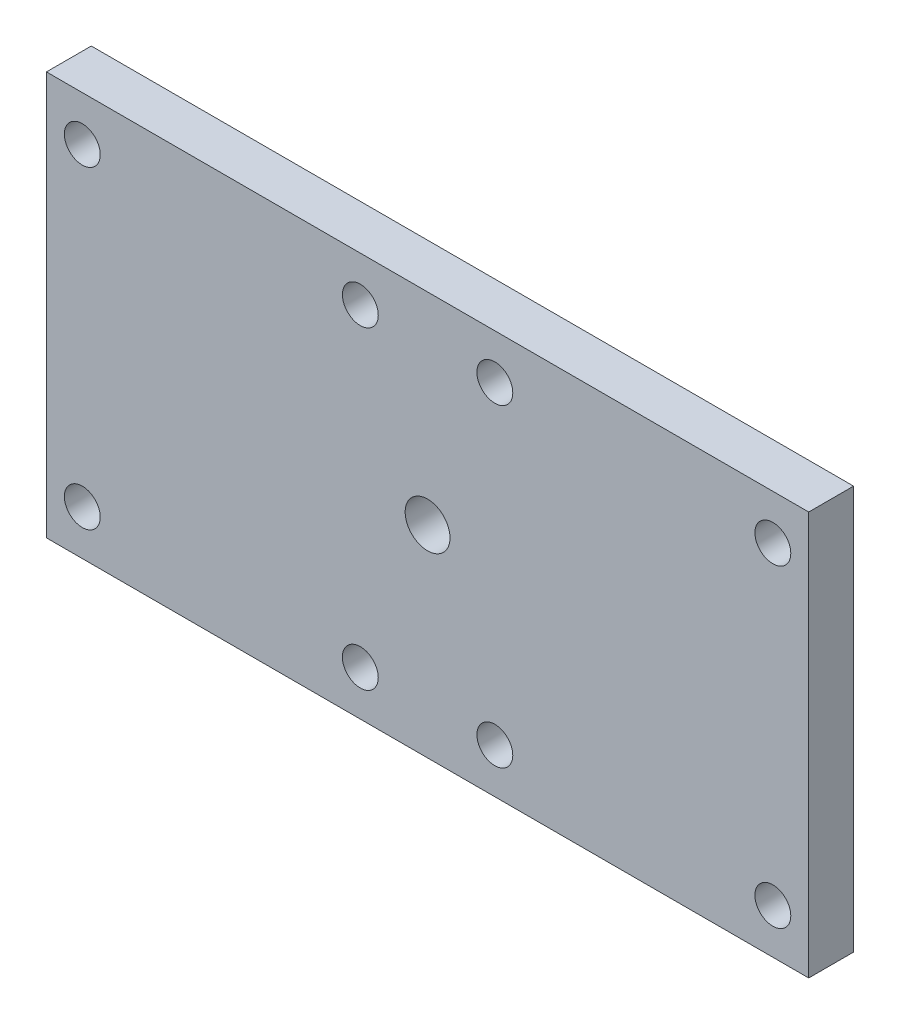
ISO-10303-21;
HEADER;
FILE_DESCRIPTION(('STEP AP214'),'2;1');
FILE_NAME('part.step','',(''),(''),'','','');
FILE_SCHEMA(('AUTOMOTIVE_DESIGN { 1 0 10303 214 1 1 1 1 }'));
ENDSEC;
DATA;
#1=APPLICATION_CONTEXT('core data for automotive mechanical design processes');
#2=APPLICATION_PROTOCOL_DEFINITION('international standard','automotive_design',2000,#1);
#3=PRODUCT_CONTEXT('',#1,'mechanical');
#4=PRODUCT('Part','Part','',(#3));
#5=PRODUCT_RELATED_PRODUCT_CATEGORY('part','',(#4));
#6=PRODUCT_DEFINITION_FORMATION('','',#4);
#7=PRODUCT_DEFINITION_CONTEXT('part definition',#1,'design');
#8=PRODUCT_DEFINITION('design','',#6,#7);
#9=PRODUCT_DEFINITION_SHAPE('','',#8);
#10=(LENGTH_UNIT() NAMED_UNIT(*) SI_UNIT(.MILLI.,.METRE.));
#11=(NAMED_UNIT(*) PLANE_ANGLE_UNIT() SI_UNIT($,.RADIAN.));
#12=(NAMED_UNIT(*) SI_UNIT($,.STERADIAN.) SOLID_ANGLE_UNIT());
#13=UNCERTAINTY_MEASURE_WITH_UNIT(LENGTH_MEASURE(1.E-05),#10,'distance_accuracy_value','');
#14=(GEOMETRIC_REPRESENTATION_CONTEXT(3) GLOBAL_UNCERTAINTY_ASSIGNED_CONTEXT((#13)) GLOBAL_UNIT_ASSIGNED_CONTEXT((#10,
#11,#12)) REPRESENTATION_CONTEXT('',''));
#15=CARTESIAN_POINT('',(0.,0.,0.));
#16=DIRECTION('',(0.,0.,1.));
#17=DIRECTION('',(1.,0.,0.));
#18=AXIS2_PLACEMENT_3D('',#15,#16,#17);
#19=CARTESIAN_POINT('',(0.,0.,5.));
#20=DIRECTION('',(-1.,0.,0.));
#21=DIRECTION('',(0.,-1.,0.));
#22=AXIS2_PLACEMENT_3D('',#19,#20,#21);
#23=PLANE('',#22);
#24=DIRECTION('',(0.,1.,0.));
#25=VECTOR('',#24,1.);
#26=CARTESIAN_POINT('',(0.,0.,0.));
#27=LINE('',#26,#25);
#28=CARTESIAN_POINT('',(0.,0.,0.));
#29=VERTEX_POINT('',#28);
#30=CARTESIAN_POINT('',(0.,44.9999999999999,0.));
#31=VERTEX_POINT('',#30);
#32=EDGE_CURVE('E215',#29,#31,#27,.T.);
#33=ORIENTED_EDGE('',*,*,#32,.T.);
#34=DIRECTION('',(0.,0.,-1.));
#35=VECTOR('',#34,1.);
#36=CARTESIAN_POINT('',(0.,44.9999999999999,5.));
#37=LINE('',#36,#35);
#38=CARTESIAN_POINT('',(0.,44.9999999999999,5.));
#39=VERTEX_POINT('',#38);
#40=EDGE_CURVE('E12',#39,#31,#37,.T.);
#41=ORIENTED_EDGE('',*,*,#40,.F.);
#42=DIRECTION('',(0.,1.,0.));
#43=VECTOR('',#42,1.);
#44=CARTESIAN_POINT('',(0.,0.,5.));
#45=LINE('',#44,#43);
#46=CARTESIAN_POINT('',(0.,0.,5.));
#47=VERTEX_POINT('',#46);
#48=EDGE_CURVE('E93',#47,#39,#45,.T.);
#49=ORIENTED_EDGE('',*,*,#48,.F.);
#50=DIRECTION('',(0.,0.,-1.));
#51=VECTOR('',#50,1.);
#52=CARTESIAN_POINT('',(0.,0.,5.));
#53=LINE('',#52,#51);
#54=EDGE_CURVE('E102',#47,#29,#53,.T.);
#55=ORIENTED_EDGE('',*,*,#54,.T.);
#56=EDGE_LOOP('',(#33,#41,#49,#55));
#57=FACE_BOUND('',#56,.T.);
#58=ADVANCED_FACE('F40',(#57),#23,.F.);
#59=CARTESIAN_POINT('',(0.,44.9999999999999,5.));
#60=DIRECTION('',(0.,-1.,0.));
#61=DIRECTION('',(1.,0.,0.));
#62=AXIS2_PLACEMENT_3D('',#59,#60,#61);
#63=PLANE('',#62);
#64=DIRECTION('',(-1.,0.,0.));
#65=VECTOR('',#64,1.);
#66=CARTESIAN_POINT('',(0.,44.9999999999999,0.));
#67=LINE('',#66,#65);
#68=CARTESIAN_POINT('',(-85.,44.9999999999999,0.));
#69=VERTEX_POINT('',#68);
#70=EDGE_CURVE('E97',#31,#69,#67,.T.);
#71=ORIENTED_EDGE('',*,*,#70,.T.);
#72=DIRECTION('',(0.,0.,-1.));
#73=VECTOR('',#72,1.);
#74=CARTESIAN_POINT('',(-85.,44.9999999999999,5.));
#75=LINE('',#74,#73);
#76=CARTESIAN_POINT('',(-85.,44.9999999999999,5.));
#77=VERTEX_POINT('',#76);
#78=EDGE_CURVE('E49',#77,#69,#75,.T.);
#79=ORIENTED_EDGE('',*,*,#78,.F.);
#80=DIRECTION('',(-1.,0.,0.));
#81=VECTOR('',#80,1.);
#82=CARTESIAN_POINT('',(0.,44.9999999999999,5.));
#83=LINE('',#82,#81);
#84=EDGE_CURVE('E88',#39,#77,#83,.T.);
#85=ORIENTED_EDGE('',*,*,#84,.F.);
#86=ORIENTED_EDGE('',*,*,#40,.T.);
#87=EDGE_LOOP('',(#71,#79,#85,#86));
#88=FACE_BOUND('',#87,.T.);
#89=ADVANCED_FACE('F96',(#88),#63,.F.);
#90=CARTESIAN_POINT('',(-85.,0.,5.));
#91=DIRECTION('',(1.,0.,0.));
#92=DIRECTION('',(0.,0.,-1.));
#93=AXIS2_PLACEMENT_3D('',#90,#91,#92);
#94=PLANE('',#93);
#95=DIRECTION('',(0.,-1.,0.));
#96=VECTOR('',#95,1.);
#97=CARTESIAN_POINT('',(-85.,0.,0.));
#98=LINE('',#97,#96);
#99=CARTESIAN_POINT('',(-85.,0.,0.));
#100=VERTEX_POINT('',#99);
#101=EDGE_CURVE('E75',#69,#100,#98,.T.);
#102=ORIENTED_EDGE('',*,*,#101,.T.);
#103=DIRECTION('',(0.,0.,-1.));
#104=VECTOR('',#103,1.);
#105=CARTESIAN_POINT('',(-85.,0.,5.));
#106=LINE('',#105,#104);
#107=CARTESIAN_POINT('',(-85.,0.,5.));
#108=VERTEX_POINT('',#107);
#109=EDGE_CURVE('E98',#108,#100,#106,.T.);
#110=ORIENTED_EDGE('',*,*,#109,.F.);
#111=DIRECTION('',(0.,-1.,0.));
#112=VECTOR('',#111,1.);
#113=CARTESIAN_POINT('',(-85.,0.,5.));
#114=LINE('',#113,#112);
#115=EDGE_CURVE('E91',#77,#108,#114,.T.);
#116=ORIENTED_EDGE('',*,*,#115,.F.);
#117=ORIENTED_EDGE('',*,*,#78,.T.);
#118=EDGE_LOOP('',(#102,#110,#116,#117));
#119=FACE_BOUND('',#118,.T.);
#120=ADVANCED_FACE('F100',(#119),#94,.F.);
#121=CARTESIAN_POINT('',(0.,0.,5.));
#122=DIRECTION('',(0.,1.,0.));
#123=DIRECTION('',(-1.,0.,0.));
#124=AXIS2_PLACEMENT_3D('',#121,#122,#123);
#125=PLANE('',#124);
#126=DIRECTION('',(1.,0.,0.));
#127=VECTOR('',#126,1.);
#128=CARTESIAN_POINT('',(0.,0.,0.));
#129=LINE('',#128,#127);
#130=EDGE_CURVE('E81',#100,#29,#129,.T.);
#131=ORIENTED_EDGE('',*,*,#130,.T.);
#132=ORIENTED_EDGE('',*,*,#54,.F.);
#133=DIRECTION('',(1.,0.,0.));
#134=VECTOR('',#133,1.);
#135=CARTESIAN_POINT('',(0.,0.,5.));
#136=LINE('',#135,#134);
#137=EDGE_CURVE('E58',#108,#47,#136,.T.);
#138=ORIENTED_EDGE('',*,*,#137,.F.);
#139=ORIENTED_EDGE('',*,*,#109,.T.);
#140=EDGE_LOOP('',(#131,#132,#138,#139));
#141=FACE_BOUND('',#140,.T.);
#142=ADVANCED_FACE('F163',(#141),#125,.F.);
#143=CARTESIAN_POINT('',(0.,0.,5.));
#144=DIRECTION('',(0.,0.,1.));
#145=DIRECTION('',(1.,0.,0.));
#146=AXIS2_PLACEMENT_3D('',#143,#144,#145);
#147=PLANE('',#146);
#148=CARTESIAN_POINT('',(-3.99999999999999,4.99999999999998,5.));
#149=DIRECTION('',(0.,0.,1.));
#150=DIRECTION('',(1.,0.,0.));
#151=AXIS2_PLACEMENT_3D('',#148,#149,#150);
#152=CIRCLE('',#151,2.);
#153=CARTESIAN_POINT('',(-1.99999999999999,4.99999999999998,5.));
#154=VERTEX_POINT('',#153);
#155=EDGE_CURVE('E147',#154,#154,#152,.T.);
#156=ORIENTED_EDGE('',*,*,#155,.F.);
#157=EDGE_LOOP('',(#156));
#158=FACE_BOUND('',#157,.T.);
#159=CARTESIAN_POINT('',(-50.,39.9999999999999,5.));
#160=DIRECTION('',(0.,0.,1.));
#161=DIRECTION('',(-1.,0.,0.));
#162=AXIS2_PLACEMENT_3D('',#159,#160,#161);
#163=CIRCLE('',#162,2.);
#164=CARTESIAN_POINT('',(-52.,39.9999999999999,5.));
#165=VERTEX_POINT('',#164);
#166=EDGE_CURVE('E124',#165,#165,#163,.T.);
#167=ORIENTED_EDGE('',*,*,#166,.F.);
#168=EDGE_LOOP('',(#167));
#169=FACE_BOUND('',#168,.T.);
#170=CARTESIAN_POINT('',(-50.,4.99999999999996,5.));
#171=DIRECTION('',(0.,0.,1.));
#172=DIRECTION('',(1.,0.,0.));
#173=AXIS2_PLACEMENT_3D('',#170,#171,#172);
#174=CIRCLE('',#173,2.);
#175=CARTESIAN_POINT('',(-48.,4.99999999999996,5.));
#176=VERTEX_POINT('',#175);
#177=EDGE_CURVE('E120',#176,#176,#174,.T.);
#178=ORIENTED_EDGE('',*,*,#177,.F.);
#179=EDGE_LOOP('',(#178));
#180=FACE_BOUND('',#179,.T.);
#181=CARTESIAN_POINT('',(-81.,4.99999999999995,5.));
#182=DIRECTION('',(0.,0.,1.));
#183=DIRECTION('',(-1.,0.,0.));
#184=AXIS2_PLACEMENT_3D('',#181,#182,#183);
#185=CIRCLE('',#184,2.);
#186=CARTESIAN_POINT('',(-83.,4.99999999999995,5.));
#187=VERTEX_POINT('',#186);
#188=EDGE_CURVE('E119',#187,#187,#185,.T.);
#189=ORIENTED_EDGE('',*,*,#188,.F.);
#190=EDGE_LOOP('',(#189));
#191=FACE_BOUND('',#190,.T.);
#192=CARTESIAN_POINT('',(-42.5,22.4999999999999,5.));
#193=DIRECTION('',(0.,0.,1.));
#194=DIRECTION('',(1.,0.,0.));
#195=AXIS2_PLACEMENT_3D('',#192,#193,#194);
#196=CIRCLE('',#195,2.5);
#197=CARTESIAN_POINT('',(-40.,22.4999999999999,5.));
#198=VERTEX_POINT('',#197);
#199=EDGE_CURVE('E137',#198,#198,#196,.T.);
#200=ORIENTED_EDGE('',*,*,#199,.F.);
#201=EDGE_LOOP('',(#200));
#202=FACE_BOUND('',#201,.T.);
#203=CARTESIAN_POINT('',(-3.99999999999999,39.9999999999999,5.));
#204=DIRECTION('',(0.,0.,1.));
#205=DIRECTION('',(-1.,0.,0.));
#206=AXIS2_PLACEMENT_3D('',#203,#204,#205);
#207=CIRCLE('',#206,2.);
#208=CARTESIAN_POINT('',(-5.99999999999999,39.9999999999999,5.));
#209=VERTEX_POINT('',#208);
#210=EDGE_CURVE('E141',#209,#209,#207,.T.);
#211=ORIENTED_EDGE('',*,*,#210,.F.);
#212=EDGE_LOOP('',(#211));
#213=FACE_BOUND('',#212,.T.);
#214=CARTESIAN_POINT('',(-35.,39.9999999999999,5.));
#215=DIRECTION('',(0.,0.,1.));
#216=DIRECTION('',(1.,0.,0.));
#217=AXIS2_PLACEMENT_3D('',#214,#215,#216);
#218=CIRCLE('',#217,2.);
#219=CARTESIAN_POINT('',(-33.,39.9999999999999,5.));
#220=VERTEX_POINT('',#219);
#221=EDGE_CURVE('E148',#220,#220,#218,.T.);
#222=ORIENTED_EDGE('',*,*,#221,.F.);
#223=EDGE_LOOP('',(#222));
#224=FACE_BOUND('',#223,.T.);
#225=CARTESIAN_POINT('',(-35.,4.99999999999999,5.));
#226=DIRECTION('',(0.,0.,1.));
#227=DIRECTION('',(-1.,0.,0.));
#228=AXIS2_PLACEMENT_3D('',#225,#226,#227);
#229=CIRCLE('',#228,2.);
#230=CARTESIAN_POINT('',(-37.,4.99999999999999,5.));
#231=VERTEX_POINT('',#230);
#232=EDGE_CURVE('E143',#231,#231,#229,.T.);
#233=ORIENTED_EDGE('',*,*,#232,.F.);
#234=EDGE_LOOP('',(#233));
#235=FACE_BOUND('',#234,.T.);
#236=CARTESIAN_POINT('',(-81.,39.9999999999999,5.));
#237=DIRECTION('',(0.,0.,1.));
#238=DIRECTION('',(1.,0.,0.));
#239=AXIS2_PLACEMENT_3D('',#236,#237,#238);
#240=CIRCLE('',#239,2.);
#241=CARTESIAN_POINT('',(-79.,39.9999999999999,5.));
#242=VERTEX_POINT('',#241);
#243=EDGE_CURVE('E114',#242,#242,#240,.T.);
#244=ORIENTED_EDGE('',*,*,#243,.F.);
#245=EDGE_LOOP('',(#244));
#246=FACE_BOUND('',#245,.T.);
#247=ORIENTED_EDGE('',*,*,#48,.T.);
#248=ORIENTED_EDGE('',*,*,#84,.T.);
#249=ORIENTED_EDGE('',*,*,#115,.T.);
#250=ORIENTED_EDGE('',*,*,#137,.T.);
#251=EDGE_LOOP('',(#247,#248,#249,#250));
#252=FACE_BOUND('',#251,.T.);
#253=ADVANCED_FACE('F89',(#158,#169,#180,#191,#202,#213,#224,#235,#246,#252),#147,.T.);
#254=CARTESIAN_POINT('',(0.,0.,0.));
#255=DIRECTION('',(0.,0.,1.));
#256=DIRECTION('',(1.,0.,0.));
#257=AXIS2_PLACEMENT_3D('',#254,#255,#256);
#258=PLANE('',#257);
#259=CARTESIAN_POINT('',(-3.99999999999999,4.99999999999998,0.));
#260=DIRECTION('',(0.,0.,1.));
#261=DIRECTION('',(1.,0.,0.));
#262=AXIS2_PLACEMENT_3D('',#259,#260,#261);
#263=CIRCLE('',#262,2.);
#264=CARTESIAN_POINT('',(-1.99999999999999,4.99999999999998,0.));
#265=VERTEX_POINT('',#264);
#266=EDGE_CURVE('E43',#265,#265,#263,.T.);
#267=ORIENTED_EDGE('',*,*,#266,.T.);
#268=EDGE_LOOP('',(#267));
#269=FACE_BOUND('',#268,.T.);
#270=CARTESIAN_POINT('',(-50.,39.9999999999999,0.));
#271=DIRECTION('',(0.,0.,1.));
#272=DIRECTION('',(1.,0.,0.));
#273=AXIS2_PLACEMENT_3D('',#270,#271,#272);
#274=CIRCLE('',#273,2.);
#275=CARTESIAN_POINT('',(-48.,39.9999999999999,0.));
#276=VERTEX_POINT('',#275);
#277=EDGE_CURVE('E210',#276,#276,#274,.T.);
#278=ORIENTED_EDGE('',*,*,#277,.T.);
#279=EDGE_LOOP('',(#278));
#280=FACE_BOUND('',#279,.T.);
#281=CARTESIAN_POINT('',(-50.,4.99999999999996,0.));
#282=DIRECTION('',(0.,0.,1.));
#283=DIRECTION('',(1.,0.,0.));
#284=AXIS2_PLACEMENT_3D('',#281,#282,#283);
#285=CIRCLE('',#284,2.);
#286=CARTESIAN_POINT('',(-48.,4.99999999999996,0.));
#287=VERTEX_POINT('',#286);
#288=EDGE_CURVE('E208',#287,#287,#285,.T.);
#289=ORIENTED_EDGE('',*,*,#288,.T.);
#290=EDGE_LOOP('',(#289));
#291=FACE_BOUND('',#290,.T.);
#292=CARTESIAN_POINT('',(-81.,4.99999999999995,0.));
#293=DIRECTION('',(0.,0.,1.));
#294=DIRECTION('',(1.,0.,0.));
#295=AXIS2_PLACEMENT_3D('',#292,#293,#294);
#296=CIRCLE('',#295,2.);
#297=CARTESIAN_POINT('',(-79.,4.99999999999995,0.));
#298=VERTEX_POINT('',#297);
#299=EDGE_CURVE('E205',#298,#298,#296,.T.);
#300=ORIENTED_EDGE('',*,*,#299,.T.);
#301=EDGE_LOOP('',(#300));
#302=FACE_BOUND('',#301,.T.);
#303=CARTESIAN_POINT('',(-42.5,22.4999999999999,0.));
#304=DIRECTION('',(0.,0.,1.));
#305=DIRECTION('',(1.,0.,0.));
#306=AXIS2_PLACEMENT_3D('',#303,#304,#305);
#307=CIRCLE('',#306,2.5);
#308=CARTESIAN_POINT('',(-40.,22.4999999999999,0.));
#309=VERTEX_POINT('',#308);
#310=EDGE_CURVE('E202',#309,#309,#307,.T.);
#311=ORIENTED_EDGE('',*,*,#310,.T.);
#312=EDGE_LOOP('',(#311));
#313=FACE_BOUND('',#312,.T.);
#314=CARTESIAN_POINT('',(-3.99999999999999,39.9999999999999,0.));
#315=DIRECTION('',(0.,0.,1.));
#316=DIRECTION('',(1.,0.,0.));
#317=AXIS2_PLACEMENT_3D('',#314,#315,#316);
#318=CIRCLE('',#317,2.);
#319=CARTESIAN_POINT('',(-1.99999999999999,39.9999999999999,0.));
#320=VERTEX_POINT('',#319);
#321=EDGE_CURVE('E199',#320,#320,#318,.T.);
#322=ORIENTED_EDGE('',*,*,#321,.T.);
#323=EDGE_LOOP('',(#322));
#324=FACE_BOUND('',#323,.T.);
#325=CARTESIAN_POINT('',(-35.,39.9999999999999,0.));
#326=DIRECTION('',(0.,0.,1.));
#327=DIRECTION('',(1.,0.,0.));
#328=AXIS2_PLACEMENT_3D('',#325,#326,#327);
#329=CIRCLE('',#328,2.);
#330=CARTESIAN_POINT('',(-33.,39.9999999999999,0.));
#331=VERTEX_POINT('',#330);
#332=EDGE_CURVE('E194',#331,#331,#329,.T.);
#333=ORIENTED_EDGE('',*,*,#332,.T.);
#334=EDGE_LOOP('',(#333));
#335=FACE_BOUND('',#334,.T.);
#336=CARTESIAN_POINT('',(-35.,4.99999999999999,0.));
#337=DIRECTION('',(0.,0.,1.));
#338=DIRECTION('',(1.,0.,0.));
#339=AXIS2_PLACEMENT_3D('',#336,#337,#338);
#340=CIRCLE('',#339,2.);
#341=CARTESIAN_POINT('',(-33.,4.99999999999999,0.));
#342=VERTEX_POINT('',#341);
#343=EDGE_CURVE('E191',#342,#342,#340,.T.);
#344=ORIENTED_EDGE('',*,*,#343,.T.);
#345=EDGE_LOOP('',(#344));
#346=FACE_BOUND('',#345,.T.);
#347=CARTESIAN_POINT('',(-81.,39.9999999999999,0.));
#348=DIRECTION('',(0.,0.,1.));
#349=DIRECTION('',(1.,0.,0.));
#350=AXIS2_PLACEMENT_3D('',#347,#348,#349);
#351=CIRCLE('',#350,2.);
#352=CARTESIAN_POINT('',(-79.,39.9999999999999,0.));
#353=VERTEX_POINT('',#352);
#354=EDGE_CURVE('E118',#353,#353,#351,.T.);
#355=ORIENTED_EDGE('',*,*,#354,.T.);
#356=EDGE_LOOP('',(#355));
#357=FACE_BOUND('',#356,.T.);
#358=ORIENTED_EDGE('',*,*,#32,.F.);
#359=ORIENTED_EDGE('',*,*,#130,.F.);
#360=ORIENTED_EDGE('',*,*,#101,.F.);
#361=ORIENTED_EDGE('',*,*,#70,.F.);
#362=EDGE_LOOP('',(#358,#359,#360,#361));
#363=FACE_BOUND('',#362,.T.);
#364=ADVANCED_FACE('F162',(#269,#280,#291,#302,#313,#324,#335,#346,#357,#363),#258,.F.);
#365=CARTESIAN_POINT('',(-81.,39.9999999999999,-5.));
#366=DIRECTION('',(0.,0.,1.));
#367=DIRECTION('',(1.,0.,0.));
#368=AXIS2_PLACEMENT_3D('',#365,#366,#367);
#369=CYLINDRICAL_SURFACE('',#368,2.);
#370=ORIENTED_EDGE('',*,*,#243,.T.);
#371=EDGE_LOOP('',(#370));
#372=FACE_BOUND('',#371,.T.);
#373=ORIENTED_EDGE('',*,*,#354,.F.);
#374=EDGE_LOOP('',(#373));
#375=FACE_BOUND('',#374,.T.);
#376=ADVANCED_FACE('F183',(#372,#375),#369,.F.);
#377=CARTESIAN_POINT('',(-35.,4.99999999999999,-5.));
#378=DIRECTION('',(0.,0.,1.));
#379=DIRECTION('',(1.,0.,0.));
#380=AXIS2_PLACEMENT_3D('',#377,#378,#379);
#381=CYLINDRICAL_SURFACE('',#380,2.);
#382=ORIENTED_EDGE('',*,*,#232,.T.);
#383=EDGE_LOOP('',(#382));
#384=FACE_BOUND('',#383,.T.);
#385=ORIENTED_EDGE('',*,*,#343,.F.);
#386=EDGE_LOOP('',(#385));
#387=FACE_BOUND('',#386,.T.);
#388=ADVANCED_FACE('F186',(#384,#387),#381,.F.);
#389=CARTESIAN_POINT('',(-35.,39.9999999999999,-5.));
#390=DIRECTION('',(0.,0.,1.));
#391=DIRECTION('',(1.,0.,0.));
#392=AXIS2_PLACEMENT_3D('',#389,#390,#391);
#393=CYLINDRICAL_SURFACE('',#392,2.);
#394=ORIENTED_EDGE('',*,*,#221,.T.);
#395=EDGE_LOOP('',(#394));
#396=FACE_BOUND('',#395,.T.);
#397=ORIENTED_EDGE('',*,*,#332,.F.);
#398=EDGE_LOOP('',(#397));
#399=FACE_BOUND('',#398,.T.);
#400=ADVANCED_FACE('F255',(#396,#399),#393,.F.);
#401=CARTESIAN_POINT('',(-3.99999999999999,39.9999999999999,-5.));
#402=DIRECTION('',(0.,0.,1.));
#403=DIRECTION('',(1.,0.,0.));
#404=AXIS2_PLACEMENT_3D('',#401,#402,#403);
#405=CYLINDRICAL_SURFACE('',#404,2.);
#406=ORIENTED_EDGE('',*,*,#210,.T.);
#407=EDGE_LOOP('',(#406));
#408=FACE_BOUND('',#407,.T.);
#409=ORIENTED_EDGE('',*,*,#321,.F.);
#410=EDGE_LOOP('',(#409));
#411=FACE_BOUND('',#410,.T.);
#412=ADVANCED_FACE('F258',(#408,#411),#405,.F.);
#413=CARTESIAN_POINT('',(-42.5,22.4999999999999,-5.));
#414=DIRECTION('',(0.,0.,1.));
#415=DIRECTION('',(1.,0.,0.));
#416=AXIS2_PLACEMENT_3D('',#413,#414,#415);
#417=CYLINDRICAL_SURFACE('',#416,2.5);
#418=ORIENTED_EDGE('',*,*,#199,.T.);
#419=EDGE_LOOP('',(#418));
#420=FACE_BOUND('',#419,.T.);
#421=ORIENTED_EDGE('',*,*,#310,.F.);
#422=EDGE_LOOP('',(#421));
#423=FACE_BOUND('',#422,.T.);
#424=ADVANCED_FACE('F248',(#420,#423),#417,.F.);
#425=CARTESIAN_POINT('',(-81.,4.99999999999995,-5.));
#426=DIRECTION('',(0.,0.,1.));
#427=DIRECTION('',(1.,0.,0.));
#428=AXIS2_PLACEMENT_3D('',#425,#426,#427);
#429=CYLINDRICAL_SURFACE('',#428,2.);
#430=ORIENTED_EDGE('',*,*,#188,.T.);
#431=EDGE_LOOP('',(#430));
#432=FACE_BOUND('',#431,.T.);
#433=ORIENTED_EDGE('',*,*,#299,.F.);
#434=EDGE_LOOP('',(#433));
#435=FACE_BOUND('',#434,.T.);
#436=ADVANCED_FACE('F244',(#432,#435),#429,.F.);
#437=CARTESIAN_POINT('',(-50.,4.99999999999996,-5.));
#438=DIRECTION('',(0.,0.,1.));
#439=DIRECTION('',(1.,0.,0.));
#440=AXIS2_PLACEMENT_3D('',#437,#438,#439);
#441=CYLINDRICAL_SURFACE('',#440,2.);
#442=ORIENTED_EDGE('',*,*,#177,.T.);
#443=EDGE_LOOP('',(#442));
#444=FACE_BOUND('',#443,.T.);
#445=ORIENTED_EDGE('',*,*,#288,.F.);
#446=EDGE_LOOP('',(#445));
#447=FACE_BOUND('',#446,.T.);
#448=ADVANCED_FACE('F240',(#444,#447),#441,.F.);
#449=CARTESIAN_POINT('',(-50.,39.9999999999999,-5.));
#450=DIRECTION('',(0.,0.,1.));
#451=DIRECTION('',(1.,0.,0.));
#452=AXIS2_PLACEMENT_3D('',#449,#450,#451);
#453=CYLINDRICAL_SURFACE('',#452,2.);
#454=ORIENTED_EDGE('',*,*,#166,.T.);
#455=EDGE_LOOP('',(#454));
#456=FACE_BOUND('',#455,.T.);
#457=ORIENTED_EDGE('',*,*,#277,.F.);
#458=EDGE_LOOP('',(#457));
#459=FACE_BOUND('',#458,.T.);
#460=ADVANCED_FACE('F243',(#456,#459),#453,.F.);
#461=CARTESIAN_POINT('',(-3.99999999999999,4.99999999999998,-5.));
#462=DIRECTION('',(0.,0.,1.));
#463=DIRECTION('',(1.,0.,0.));
#464=AXIS2_PLACEMENT_3D('',#461,#462,#463);
#465=CYLINDRICAL_SURFACE('',#464,2.);
#466=ORIENTED_EDGE('',*,*,#155,.T.);
#467=EDGE_LOOP('',(#466));
#468=FACE_BOUND('',#467,.T.);
#469=ORIENTED_EDGE('',*,*,#266,.F.);
#470=EDGE_LOOP('',(#469));
#471=FACE_BOUND('',#470,.T.);
#472=ADVANCED_FACE('F157',(#468,#471),#465,.F.);
#473=CLOSED_SHELL('',(#58,#89,#120,#142,#253,#364,#376,#388,#400,#412,#424,#436,#448,#460,#472));
#474=MANIFOLD_SOLID_BREP('B2',#473);
#475=ADVANCED_BREP_SHAPE_REPRESENTATION('',(#18,#474),#14);
#476=SHAPE_DEFINITION_REPRESENTATION(#9,#475);
ENDSEC;
END-ISO-10303-21;
